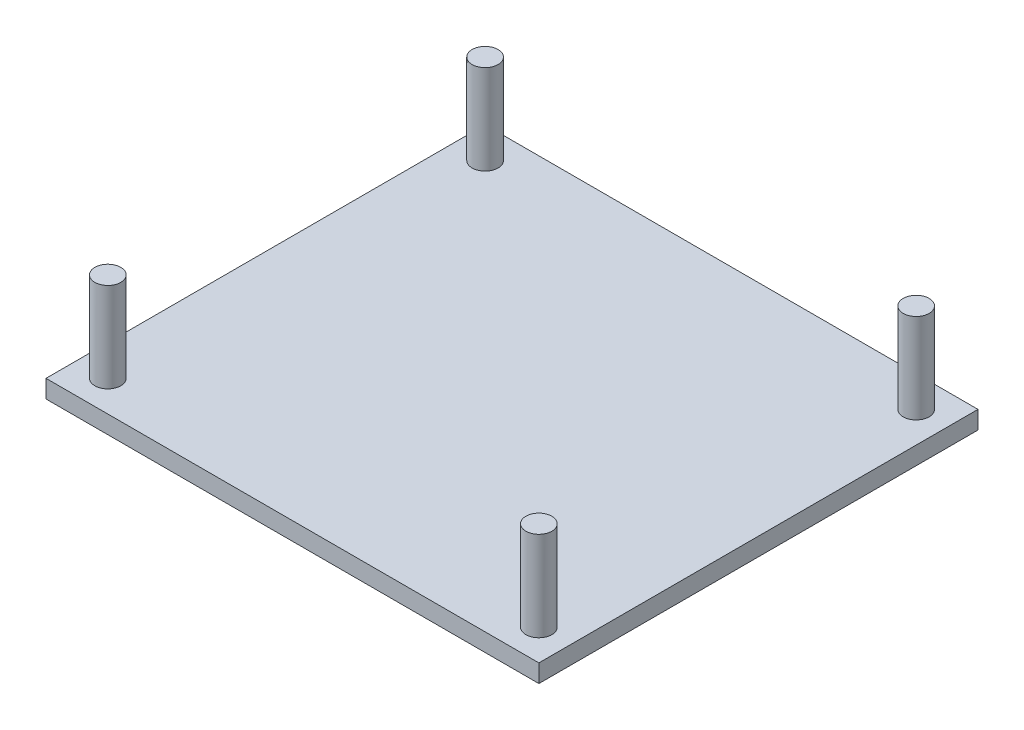
ISO-10303-21;
HEADER;
FILE_DESCRIPTION(('STEP AP214'),'2;1');
FILE_NAME('part.step','',(''),(''),'','','');
FILE_SCHEMA(('AUTOMOTIVE_DESIGN { 1 0 10303 214 1 1 1 1 }'));
ENDSEC;
DATA;
#1=APPLICATION_CONTEXT('core data for automotive mechanical design processes');
#2=APPLICATION_PROTOCOL_DEFINITION('international standard','automotive_design',2000,#1);
#3=PRODUCT_CONTEXT('',#1,'mechanical');
#4=PRODUCT('Part','Part','',(#3));
#5=PRODUCT_RELATED_PRODUCT_CATEGORY('part','',(#4));
#6=PRODUCT_DEFINITION_FORMATION('','',#4);
#7=PRODUCT_DEFINITION_CONTEXT('part definition',#1,'design');
#8=PRODUCT_DEFINITION('design','',#6,#7);
#9=PRODUCT_DEFINITION_SHAPE('','',#8);
#10=(LENGTH_UNIT() NAMED_UNIT(*) SI_UNIT(.MILLI.,.METRE.));
#11=(NAMED_UNIT(*) PLANE_ANGLE_UNIT() SI_UNIT($,.RADIAN.));
#12=(NAMED_UNIT(*) SI_UNIT($,.STERADIAN.) SOLID_ANGLE_UNIT());
#13=UNCERTAINTY_MEASURE_WITH_UNIT(LENGTH_MEASURE(1.E-05),#10,'distance_accuracy_value','');
#14=(GEOMETRIC_REPRESENTATION_CONTEXT(3) GLOBAL_UNCERTAINTY_ASSIGNED_CONTEXT((#13)) GLOBAL_UNIT_ASSIGNED_CONTEXT((#10,
#11,#12)) REPRESENTATION_CONTEXT('',''));
#15=CARTESIAN_POINT('',(0.,0.,0.));
#16=DIRECTION('',(0.,0.,1.));
#17=DIRECTION('',(1.,0.,0.));
#18=AXIS2_PLACEMENT_3D('',#15,#16,#17);
#19=CARTESIAN_POINT('',(0.,-2.,0.));
#20=DIRECTION('',(-1.,0.,0.));
#21=DIRECTION('',(0.,0.,1.));
#22=AXIS2_PLACEMENT_3D('',#19,#20,#21);
#23=PLANE('',#22);
#24=DIRECTION('',(0.,0.,1.));
#25=VECTOR('',#24,1.);
#26=CARTESIAN_POINT('',(0.,0.,0.));
#27=LINE('',#26,#25);
#28=CARTESIAN_POINT('',(0.,0.,-49.));
#29=VERTEX_POINT('',#28);
#30=CARTESIAN_POINT('',(0.,0.,0.));
#31=VERTEX_POINT('',#30);
#32=EDGE_CURVE('E101',#29,#31,#27,.T.);
#33=ORIENTED_EDGE('',*,*,#32,.F.);
#34=DIRECTION('',(0.,1.,0.));
#35=VECTOR('',#34,1.);
#36=CARTESIAN_POINT('',(0.,-2.,-49.));
#37=LINE('',#36,#35);
#38=CARTESIAN_POINT('',(0.,-2.,-49.));
#39=VERTEX_POINT('',#38);
#40=EDGE_CURVE('E49',#39,#29,#37,.T.);
#41=ORIENTED_EDGE('',*,*,#40,.F.);
#42=DIRECTION('',(0.,0.,1.));
#43=VECTOR('',#42,1.);
#44=CARTESIAN_POINT('',(0.,-2.,0.));
#45=LINE('',#44,#43);
#46=CARTESIAN_POINT('',(0.,-2.,0.));
#47=VERTEX_POINT('',#46);
#48=EDGE_CURVE('E94',#39,#47,#45,.T.);
#49=ORIENTED_EDGE('',*,*,#48,.T.);
#50=DIRECTION('',(0.,1.,0.));
#51=VECTOR('',#50,1.);
#52=CARTESIAN_POINT('',(0.,-2.,0.));
#53=LINE('',#52,#51);
#54=EDGE_CURVE('E77',#47,#31,#53,.T.);
#55=ORIENTED_EDGE('',*,*,#54,.T.);
#56=EDGE_LOOP('',(#33,#41,#49,#55));
#57=FACE_BOUND('',#56,.T.);
#58=ADVANCED_FACE('F33',(#57),#23,.T.);
#59=CARTESIAN_POINT('',(0.,-2.,-49.));
#60=DIRECTION('',(0.,0.,-1.));
#61=DIRECTION('',(-1.,0.,0.));
#62=AXIS2_PLACEMENT_3D('',#59,#60,#61);
#63=PLANE('',#62);
#64=DIRECTION('',(-1.,0.,0.));
#65=VECTOR('',#64,1.);
#66=CARTESIAN_POINT('',(0.,0.,-49.));
#67=LINE('',#66,#65);
#68=CARTESIAN_POINT('',(55.,0.,-49.));
#69=VERTEX_POINT('',#68);
#70=EDGE_CURVE('E96',#69,#29,#67,.T.);
#71=ORIENTED_EDGE('',*,*,#70,.F.);
#72=DIRECTION('',(0.,1.,0.));
#73=VECTOR('',#72,1.);
#74=CARTESIAN_POINT('',(55.,-2.,-49.));
#75=LINE('',#74,#73);
#76=CARTESIAN_POINT('',(55.,-2.,-49.));
#77=VERTEX_POINT('',#76);
#78=EDGE_CURVE('E66',#77,#69,#75,.T.);
#79=ORIENTED_EDGE('',*,*,#78,.F.);
#80=DIRECTION('',(-1.,0.,0.));
#81=VECTOR('',#80,1.);
#82=CARTESIAN_POINT('',(0.,-2.,-49.));
#83=LINE('',#82,#81);
#84=EDGE_CURVE('E91',#77,#39,#83,.T.);
#85=ORIENTED_EDGE('',*,*,#84,.T.);
#86=ORIENTED_EDGE('',*,*,#40,.T.);
#87=EDGE_LOOP('',(#71,#79,#85,#86));
#88=FACE_BOUND('',#87,.T.);
#89=ADVANCED_FACE('F133',(#88),#63,.T.);
#90=CARTESIAN_POINT('',(55.,-2.,0.));
#91=DIRECTION('',(1.,0.,0.));
#92=DIRECTION('',(0.,0.,-1.));
#93=AXIS2_PLACEMENT_3D('',#90,#91,#92);
#94=PLANE('',#93);
#95=DIRECTION('',(0.,0.,-1.));
#96=VECTOR('',#95,1.);
#97=CARTESIAN_POINT('',(55.,0.,0.));
#98=LINE('',#97,#96);
#99=CARTESIAN_POINT('',(55.,0.,0.));
#100=VERTEX_POINT('',#99);
#101=EDGE_CURVE('E85',#100,#69,#98,.T.);
#102=ORIENTED_EDGE('',*,*,#101,.F.);
#103=DIRECTION('',(0.,1.,0.));
#104=VECTOR('',#103,1.);
#105=CARTESIAN_POINT('',(55.,-2.,0.));
#106=LINE('',#105,#104);
#107=CARTESIAN_POINT('',(55.,-2.,0.));
#108=VERTEX_POINT('',#107);
#109=EDGE_CURVE('E80',#108,#100,#106,.T.);
#110=ORIENTED_EDGE('',*,*,#109,.F.);
#111=DIRECTION('',(0.,0.,-1.));
#112=VECTOR('',#111,1.);
#113=CARTESIAN_POINT('',(55.,-2.,0.));
#114=LINE('',#113,#112);
#115=EDGE_CURVE('E83',#108,#77,#114,.T.);
#116=ORIENTED_EDGE('',*,*,#115,.T.);
#117=ORIENTED_EDGE('',*,*,#78,.T.);
#118=EDGE_LOOP('',(#102,#110,#116,#117));
#119=FACE_BOUND('',#118,.T.);
#120=ADVANCED_FACE('F82',(#119),#94,.T.);
#121=CARTESIAN_POINT('',(0.,-2.,0.));
#122=DIRECTION('',(0.,0.,1.));
#123=DIRECTION('',(1.,0.,0.));
#124=AXIS2_PLACEMENT_3D('',#121,#122,#123);
#125=PLANE('',#124);
#126=DIRECTION('',(1.,0.,0.));
#127=VECTOR('',#126,1.);
#128=CARTESIAN_POINT('',(0.,0.,0.));
#129=LINE('',#128,#127);
#130=EDGE_CURVE('E104',#31,#100,#129,.T.);
#131=ORIENTED_EDGE('',*,*,#130,.F.);
#132=ORIENTED_EDGE('',*,*,#54,.F.);
#133=DIRECTION('',(1.,0.,0.));
#134=VECTOR('',#133,1.);
#135=CARTESIAN_POINT('',(0.,-2.,0.));
#136=LINE('',#135,#134);
#137=EDGE_CURVE('E90',#47,#108,#136,.T.);
#138=ORIENTED_EDGE('',*,*,#137,.T.);
#139=ORIENTED_EDGE('',*,*,#109,.T.);
#140=EDGE_LOOP('',(#131,#132,#138,#139));
#141=FACE_BOUND('',#140,.T.);
#142=ADVANCED_FACE('F93',(#141),#125,.T.);
#143=CARTESIAN_POINT('',(0.,-2.,0.));
#144=DIRECTION('',(0.,-1.,0.));
#145=DIRECTION('',(0.,0.,-1.));
#146=AXIS2_PLACEMENT_3D('',#143,#144,#145);
#147=PLANE('',#146);
#148=ORIENTED_EDGE('',*,*,#48,.F.);
#149=ORIENTED_EDGE('',*,*,#84,.F.);
#150=ORIENTED_EDGE('',*,*,#115,.F.);
#151=ORIENTED_EDGE('',*,*,#137,.F.);
#152=EDGE_LOOP('',(#148,#149,#150,#151));
#153=FACE_BOUND('',#152,.T.);
#154=ADVANCED_FACE('F89',(#153),#147,.T.);
#155=CARTESIAN_POINT('',(0.,0.,0.));
#156=DIRECTION('',(0.,-1.,0.));
#157=DIRECTION('',(0.,0.,-1.));
#158=AXIS2_PLACEMENT_3D('',#155,#156,#157);
#159=PLANE('',#158);
#160=CARTESIAN_POINT('',(3.45,0.,-45.55));
#161=DIRECTION('',(0.,-1.,0.));
#162=DIRECTION('',(0.,0.,-1.));
#163=AXIS2_PLACEMENT_3D('',#160,#161,#162);
#164=CIRCLE('',#163,1.45);
#165=CARTESIAN_POINT('',(3.45,0.,-47.));
#166=VERTEX_POINT('',#165);
#167=EDGE_CURVE('E11',#166,#166,#164,.F.);
#168=ORIENTED_EDGE('',*,*,#167,.F.);
#169=EDGE_LOOP('',(#168));
#170=FACE_BOUND('',#169,.T.);
#171=CARTESIAN_POINT('',(51.550000042,0.,-45.55));
#172=DIRECTION('',(0.,-1.,0.));
#173=DIRECTION('',(0.,0.,-1.));
#174=AXIS2_PLACEMENT_3D('',#171,#172,#173);
#175=CIRCLE('',#174,1.45);
#176=CARTESIAN_POINT('',(51.550000042,0.,-47.));
#177=VERTEX_POINT('',#176);
#178=EDGE_CURVE('E41',#177,#177,#175,.F.);
#179=ORIENTED_EDGE('',*,*,#178,.F.);
#180=EDGE_LOOP('',(#179));
#181=FACE_BOUND('',#180,.T.);
#182=CARTESIAN_POINT('',(51.550000042,0.,-3.45));
#183=DIRECTION('',(0.,-1.,0.));
#184=DIRECTION('',(0.,0.,-1.));
#185=AXIS2_PLACEMENT_3D('',#182,#183,#184);
#186=CIRCLE('',#185,1.45);
#187=CARTESIAN_POINT('',(51.550000042,0.,-4.9));
#188=VERTEX_POINT('',#187);
#189=EDGE_CURVE('E116',#188,#188,#186,.F.);
#190=ORIENTED_EDGE('',*,*,#189,.F.);
#191=EDGE_LOOP('',(#190));
#192=FACE_BOUND('',#191,.T.);
#193=CARTESIAN_POINT('',(3.45,0.,-3.45));
#194=DIRECTION('',(0.,-1.,0.));
#195=DIRECTION('',(0.,0.,-1.));
#196=AXIS2_PLACEMENT_3D('',#193,#194,#195);
#197=CIRCLE('',#196,1.45);
#198=CARTESIAN_POINT('',(3.45,0.,-4.9));
#199=VERTEX_POINT('',#198);
#200=EDGE_CURVE('E111',#199,#199,#197,.F.);
#201=ORIENTED_EDGE('',*,*,#200,.F.);
#202=EDGE_LOOP('',(#201));
#203=FACE_BOUND('',#202,.T.);
#204=ORIENTED_EDGE('',*,*,#32,.T.);
#205=ORIENTED_EDGE('',*,*,#130,.T.);
#206=ORIENTED_EDGE('',*,*,#101,.T.);
#207=ORIENTED_EDGE('',*,*,#70,.T.);
#208=EDGE_LOOP('',(#204,#205,#206,#207));
#209=FACE_BOUND('',#208,.T.);
#210=ADVANCED_FACE('F123',(#170,#181,#192,#203,#209),#159,.F.);
#211=CARTESIAN_POINT('',(3.45,10.,-3.45));
#212=DIRECTION('',(0.,-1.,0.));
#213=DIRECTION('',(0.,0.,-1.));
#214=AXIS2_PLACEMENT_3D('',#211,#212,#213);
#215=CYLINDRICAL_SURFACE('',#214,1.45);
#216=CARTESIAN_POINT('',(3.45,10.,-3.45));
#217=DIRECTION('',(0.,1.,0.));
#218=DIRECTION('',(0.,0.,1.));
#219=AXIS2_PLACEMENT_3D('',#216,#217,#218);
#220=CIRCLE('',#219,1.45);
#221=CARTESIAN_POINT('',(3.45,10.,-2.));
#222=VERTEX_POINT('',#221);
#223=EDGE_CURVE('E105',#222,#222,#220,.T.);
#224=ORIENTED_EDGE('',*,*,#223,.F.);
#225=EDGE_LOOP('',(#224));
#226=FACE_BOUND('',#225,.T.);
#227=ORIENTED_EDGE('',*,*,#200,.T.);
#228=EDGE_LOOP('',(#227));
#229=FACE_BOUND('',#228,.T.);
#230=ADVANCED_FACE('F126',(#226,#229),#215,.T.);
#231=CARTESIAN_POINT('',(3.45,10.,-3.45));
#232=DIRECTION('',(0.,1.,0.));
#233=DIRECTION('',(0.,0.,1.));
#234=AXIS2_PLACEMENT_3D('',#231,#232,#233);
#235=PLANE('',#234);
#236=ORIENTED_EDGE('',*,*,#223,.T.);
#237=EDGE_LOOP('',(#236));
#238=FACE_BOUND('',#237,.T.);
#239=ADVANCED_FACE('F151',(#238),#235,.T.);
#240=CARTESIAN_POINT('',(51.550000042,10.,-3.45));
#241=DIRECTION('',(0.,-1.,0.));
#242=DIRECTION('',(0.,0.,-1.));
#243=AXIS2_PLACEMENT_3D('',#240,#241,#242);
#244=CYLINDRICAL_SURFACE('',#243,1.45);
#245=CARTESIAN_POINT('',(51.550000042,10.,-3.45));
#246=DIRECTION('',(0.,1.,0.));
#247=DIRECTION('',(0.,0.,1.));
#248=AXIS2_PLACEMENT_3D('',#245,#246,#247);
#249=CIRCLE('',#248,1.45);
#250=CARTESIAN_POINT('',(51.550000042,10.,-2.));
#251=VERTEX_POINT('',#250);
#252=EDGE_CURVE('E186',#251,#251,#249,.T.);
#253=ORIENTED_EDGE('',*,*,#252,.F.);
#254=EDGE_LOOP('',(#253));
#255=FACE_BOUND('',#254,.T.);
#256=ORIENTED_EDGE('',*,*,#189,.T.);
#257=EDGE_LOOP('',(#256));
#258=FACE_BOUND('',#257,.T.);
#259=ADVANCED_FACE('F155',(#255,#258),#244,.T.);
#260=CARTESIAN_POINT('',(51.550000042,10.,-3.45));
#261=DIRECTION('',(0.,1.,0.));
#262=DIRECTION('',(0.,0.,1.));
#263=AXIS2_PLACEMENT_3D('',#260,#261,#262);
#264=PLANE('',#263);
#265=ORIENTED_EDGE('',*,*,#252,.T.);
#266=EDGE_LOOP('',(#265));
#267=FACE_BOUND('',#266,.T.);
#268=ADVANCED_FACE('F159',(#267),#264,.T.);
#269=CARTESIAN_POINT('',(51.550000042,10.,-45.55));
#270=DIRECTION('',(0.,-1.,0.));
#271=DIRECTION('',(0.,0.,-1.));
#272=AXIS2_PLACEMENT_3D('',#269,#270,#271);
#273=CYLINDRICAL_SURFACE('',#272,1.45);
#274=CARTESIAN_POINT('',(51.550000042,10.,-45.55));
#275=DIRECTION('',(0.,1.,0.));
#276=DIRECTION('',(0.,0.,-1.));
#277=AXIS2_PLACEMENT_3D('',#274,#275,#276);
#278=CIRCLE('',#277,1.45);
#279=CARTESIAN_POINT('',(51.550000042,10.,-47.));
#280=VERTEX_POINT('',#279);
#281=EDGE_CURVE('E183',#280,#280,#278,.T.);
#282=ORIENTED_EDGE('',*,*,#281,.F.);
#283=EDGE_LOOP('',(#282));
#284=FACE_BOUND('',#283,.T.);
#285=ORIENTED_EDGE('',*,*,#178,.T.);
#286=EDGE_LOOP('',(#285));
#287=FACE_BOUND('',#286,.T.);
#288=ADVANCED_FACE('F121',(#284,#287),#273,.T.);
#289=CARTESIAN_POINT('',(51.550000042,10.,-45.55));
#290=DIRECTION('',(0.,-1.,0.));
#291=DIRECTION('',(0.,0.,-1.));
#292=AXIS2_PLACEMENT_3D('',#289,#290,#291);
#293=PLANE('',#292);
#294=ORIENTED_EDGE('',*,*,#281,.T.);
#295=EDGE_LOOP('',(#294));
#296=FACE_BOUND('',#295,.T.);
#297=ADVANCED_FACE('F166',(#296),#293,.F.);
#298=CARTESIAN_POINT('',(3.45,10.,-45.55));
#299=DIRECTION('',(0.,-1.,0.));
#300=DIRECTION('',(0.,0.,-1.));
#301=AXIS2_PLACEMENT_3D('',#298,#299,#300);
#302=CYLINDRICAL_SURFACE('',#301,1.45);
#303=CARTESIAN_POINT('',(3.45,10.,-45.55));
#304=DIRECTION('',(0.,1.,0.));
#305=DIRECTION('',(0.,0.,-1.));
#306=AXIS2_PLACEMENT_3D('',#303,#304,#305);
#307=CIRCLE('',#306,1.45);
#308=CARTESIAN_POINT('',(3.45,10.,-47.));
#309=VERTEX_POINT('',#308);
#310=EDGE_CURVE('E182',#309,#309,#307,.T.);
#311=ORIENTED_EDGE('',*,*,#310,.F.);
#312=EDGE_LOOP('',(#311));
#313=FACE_BOUND('',#312,.T.);
#314=ORIENTED_EDGE('',*,*,#167,.T.);
#315=EDGE_LOOP('',(#314));
#316=FACE_BOUND('',#315,.T.);
#317=ADVANCED_FACE('F170',(#313,#316),#302,.T.);
#318=CARTESIAN_POINT('',(3.45,10.,-45.55));
#319=DIRECTION('',(0.,-1.,0.));
#320=DIRECTION('',(0.,0.,-1.));
#321=AXIS2_PLACEMENT_3D('',#318,#319,#320);
#322=PLANE('',#321);
#323=ORIENTED_EDGE('',*,*,#310,.T.);
#324=EDGE_LOOP('',(#323));
#325=FACE_BOUND('',#324,.T.);
#326=ADVANCED_FACE('F174',(#325),#322,.F.);
#327=CLOSED_SHELL('',(#58,#89,#120,#142,#154,#210,#230,#239,#259,#268,#288,#297,#317,#326));
#328=MANIFOLD_SOLID_BREP('B2',#327);
#329=ADVANCED_BREP_SHAPE_REPRESENTATION('',(#18,#328),#14);
#330=SHAPE_DEFINITION_REPRESENTATION(#9,#329);
ENDSEC;
END-ISO-10303-21;
